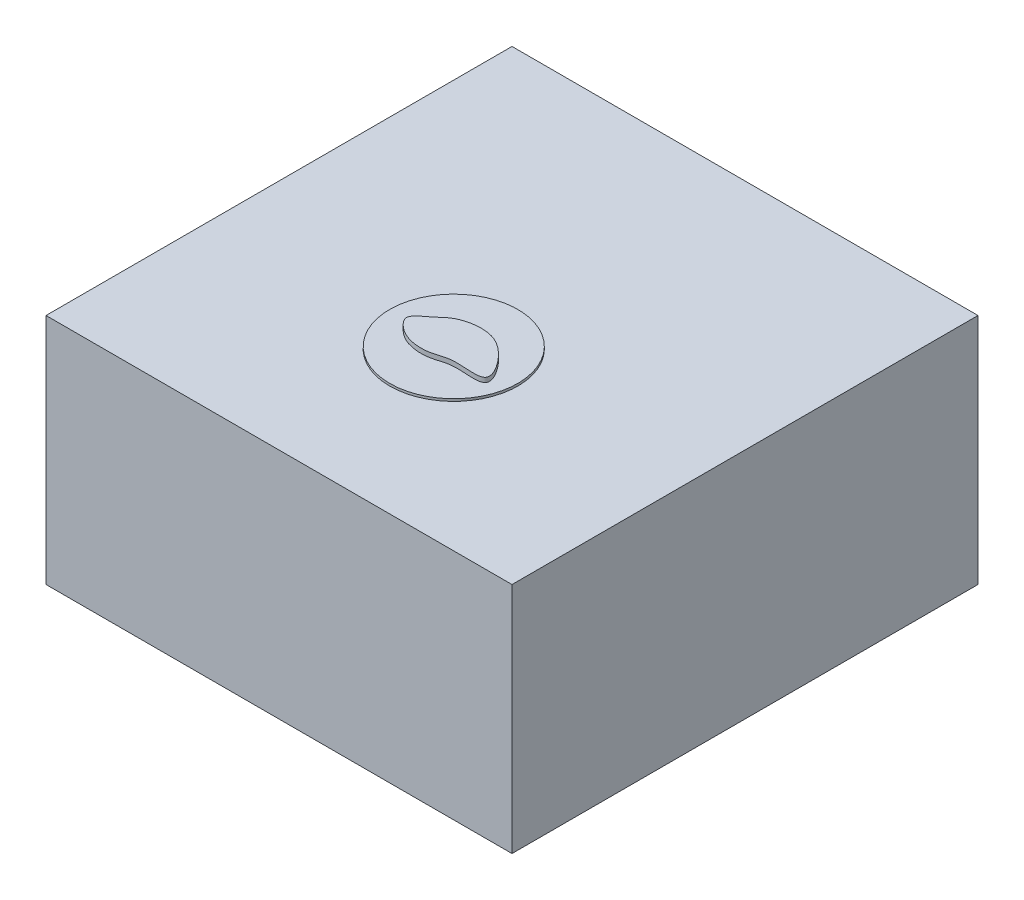
ISO-10303-21;
HEADER;
FILE_DESCRIPTION(('STEP AP214'),'2;1');
FILE_NAME('part.step','',(''),(''),'','','');
FILE_SCHEMA(('AUTOMOTIVE_DESIGN { 1 0 10303 214 1 1 1 1 }'));
ENDSEC;
DATA;
#1=APPLICATION_CONTEXT('core data for automotive mechanical design processes');
#2=APPLICATION_PROTOCOL_DEFINITION('international standard','automotive_design',2000,#1);
#3=PRODUCT_CONTEXT('',#1,'mechanical');
#4=PRODUCT('Part','Part','',(#3));
#5=PRODUCT_RELATED_PRODUCT_CATEGORY('part','',(#4));
#6=PRODUCT_DEFINITION_FORMATION('','',#4);
#7=PRODUCT_DEFINITION_CONTEXT('part definition',#1,'design');
#8=PRODUCT_DEFINITION('design','',#6,#7);
#9=PRODUCT_DEFINITION_SHAPE('','',#8);
#10=(LENGTH_UNIT() NAMED_UNIT(*) SI_UNIT(.MILLI.,.METRE.));
#11=(NAMED_UNIT(*) PLANE_ANGLE_UNIT() SI_UNIT($,.RADIAN.));
#12=(NAMED_UNIT(*) SI_UNIT($,.STERADIAN.) SOLID_ANGLE_UNIT());
#13=UNCERTAINTY_MEASURE_WITH_UNIT(LENGTH_MEASURE(1.E-05),#10,'distance_accuracy_value','');
#14=(GEOMETRIC_REPRESENTATION_CONTEXT(3) GLOBAL_UNCERTAINTY_ASSIGNED_CONTEXT((#13)) GLOBAL_UNIT_ASSIGNED_CONTEXT((#10,
#11,#12)) REPRESENTATION_CONTEXT('',''));
#15=CARTESIAN_POINT('',(0.,0.,0.));
#16=DIRECTION('',(0.,0.,1.));
#17=DIRECTION('',(1.,0.,0.));
#18=AXIS2_PLACEMENT_3D('',#15,#16,#17);
#19=CARTESIAN_POINT('',(-1.32978682457797,5.3,12.0470966404881));
#20=CARTESIAN_POINT('',(-1.56949938233388,5.3,12.2405123536894));
#21=CARTESIAN_POINT('',(-2.08614424851907,5.3,12.5391697720833));
#22=CARTESIAN_POINT('',(-1.58643209411403,5.3,13.1168891119311));
#23=CARTESIAN_POINT('',(-0.99479110722871,5.3,13.4609601521511));
#24=CARTESIAN_POINT('',(-0.122057096544853,5.3,13.5063472457396));
#25=CARTESIAN_POINT('',(0.780549472015395,5.3,13.1044677868928));
#26=CARTESIAN_POINT('',(2.65290980881673,5.3,13.5718372621998));
#27=CARTESIAN_POINT('',(1.37260667116618,5.3,11.7465735610997));
#28=CARTESIAN_POINT('',(0.251281573482777,5.3,11.3225744749199));
#29=CARTESIAN_POINT('',(-0.824147776626976,5.3,11.5489578340658));
#30=CARTESIAN_POINT('',(-1.19634203116918,5.3,11.9394246848268));
#31=CARTESIAN_POINT('',(-1.32978682457797,5.3,12.0470966404881));
#32=B_SPLINE_CURVE_WITH_KNOTS('',3,(#19,#20,#21,#22,#23,#24,#25,#26,#27,#28,#29,#30,#31),
.UNSPECIFIED.,.T.,.F.,(4,1,1,1,1,1,1,1,1,1,4),(0.,0.0890314863366276,0.133435272323839,
0.204833870138696,0.315562123210451,0.38661889368764,0.538438655581061,0.696738525235763,
0.817182112999442,0.95043735542146,1.),.UNSPECIFIED.);
#33=DIRECTION('',(0.,-1.,0.));
#34=VECTOR('',#33,1.);
#35=SURFACE_OF_LINEAR_EXTRUSION('',#32,#34);
#36=CARTESIAN_POINT('',(-1.32978682457797,5.3,12.0470966404881));
#37=VERTEX_POINT('',#36);
#38=EDGE_CURVE('E11',#37,#37,#32,.T.);
#39=ORIENTED_EDGE('',*,*,#38,.F.);
#40=EDGE_LOOP('',(#39));
#41=FACE_BOUND('',#40,.T.);
#42=CARTESIAN_POINT('',(-1.32978682457797,5.,12.0470966404881));
#43=CARTESIAN_POINT('',(-1.56949938233388,5.,12.2405123536894));
#44=CARTESIAN_POINT('',(-2.08614424851907,5.,12.5391697720833));
#45=CARTESIAN_POINT('',(-1.58643209411403,5.,13.1168891119311));
#46=CARTESIAN_POINT('',(-0.99479110722871,5.,13.4609601521511));
#47=CARTESIAN_POINT('',(-0.122057096544853,5.,13.5063472457396));
#48=CARTESIAN_POINT('',(0.780549472015395,5.,13.1044677868928));
#49=CARTESIAN_POINT('',(2.65290980881673,5.,13.5718372621998));
#50=CARTESIAN_POINT('',(1.37260667116618,5.,11.7465735610997));
#51=CARTESIAN_POINT('',(0.251281573482777,5.,11.3225744749199));
#52=CARTESIAN_POINT('',(-0.824147776626976,5.,11.5489578340658));
#53=CARTESIAN_POINT('',(-1.19634203116918,5.,11.9394246848268));
#54=CARTESIAN_POINT('',(-1.32978682457797,5.,12.0470966404881));
#55=B_SPLINE_CURVE_WITH_KNOTS('',3,(#42,#43,#44,#45,#46,#47,#48,#49,#50,#51,#52,#53,#54),
.UNSPECIFIED.,.T.,.F.,(4,1,1,1,1,1,1,1,1,1,4),(0.,0.0890314863366276,0.133435272323839,
0.204833870138696,0.315562123210451,0.38661889368764,0.538438655581061,0.696738525235763,
0.817182112999442,0.95043735542146,1.),.UNSPECIFIED.);
#56=CARTESIAN_POINT('',(-1.32978682457797,5.,12.0470966404881));
#57=VERTEX_POINT('',#56);
#58=EDGE_CURVE('E45',#57,#57,#55,.T.);
#59=ORIENTED_EDGE('',*,*,#58,.T.);
#60=EDGE_LOOP('',(#59));
#61=FACE_BOUND('',#60,.T.);
#62=ADVANCED_FACE('F41',(#41,#61),#35,.F.);
#63=CARTESIAN_POINT('',(1.81422588975815,5.3,13.257386496687));
#64=DIRECTION('',(0.,-1.,0.));
#65=DIRECTION('',(0.,0.,-1.));
#66=AXIS2_PLACEMENT_3D('',#63,#64,#65);
#67=PLANE('',#66);
#68=ORIENTED_EDGE('',*,*,#38,.T.);
#69=EDGE_LOOP('',(#68));
#70=FACE_BOUND('',#69,.T.);
#71=ADVANCED_FACE('F64',(#70),#67,.F.);
#72=CARTESIAN_POINT('',(1.81422588975815,5.,13.257386496687));
#73=DIRECTION('',(0.,-1.,0.));
#74=DIRECTION('',(0.,0.,-1.));
#75=AXIS2_PLACEMENT_3D('',#72,#73,#74);
#76=PLANE('',#75);
#77=ORIENTED_EDGE('',*,*,#58,.F.);
#78=EDGE_LOOP('',(#77));
#79=FACE_BOUND('',#78,.T.);
#80=ADVANCED_FACE('F62',(#79),#76,.T.);
#81=CLOSED_SHELL('',(#62,#71,#80));
#82=MANIFOLD_SOLID_BREP('B2',#81);
#83=CARTESIAN_POINT('',(0.5,5.,12.5));
#84=DIRECTION('',(0.,1.,0.));
#85=DIRECTION('',(0.,0.,1.));
#86=AXIS2_PLACEMENT_3D('',#83,#84,#85);
#87=CYLINDRICAL_SURFACE('',#86,0.00500000000000103);
#88=CARTESIAN_POINT('',(0.5,5.,12.5));
#89=DIRECTION('',(0.,-1.,0.));
#90=DIRECTION('',(0.,0.,1.));
#91=AXIS2_PLACEMENT_3D('',#88,#89,#90);
#92=CIRCLE('',#91,0.00500000000000103);
#93=CARTESIAN_POINT('',(0.5,5.,12.505));
#94=VERTEX_POINT('',#93);
#95=EDGE_CURVE('E40',#94,#94,#92,.T.);
#96=ORIENTED_EDGE('',*,*,#95,.F.);
#97=EDGE_LOOP('',(#96));
#98=FACE_BOUND('',#97,.T.);
#99=CARTESIAN_POINT('',(0.5,5.1,12.5));
#100=DIRECTION('',(0.,-1.,0.));
#101=DIRECTION('',(0.,0.,1.));
#102=AXIS2_PLACEMENT_3D('',#99,#100,#101);
#103=CIRCLE('',#102,0.00500000000000103);
#104=CARTESIAN_POINT('',(0.5,5.1,12.505));
#105=VERTEX_POINT('',#104);
#106=EDGE_CURVE('E103',#105,#105,#103,.T.);
#107=ORIENTED_EDGE('',*,*,#106,.T.);
#108=EDGE_LOOP('',(#107));
#109=FACE_BOUND('',#108,.T.);
#110=ADVANCED_FACE('F100',(#98,#109),#87,.T.);
#111=CARTESIAN_POINT('',(0.5,5.,12.5));
#112=DIRECTION('',(0.,1.,0.));
#113=DIRECTION('',(0.,0.,1.));
#114=AXIS2_PLACEMENT_3D('',#111,#112,#113);
#115=PLANE('',#114);
#116=ORIENTED_EDGE('',*,*,#95,.T.);
#117=EDGE_LOOP('',(#116));
#118=FACE_BOUND('',#117,.T.);
#119=ADVANCED_FACE('F115',(#118),#115,.F.);
#120=CARTESIAN_POINT('',(0.5,5.1,12.5));
#121=DIRECTION('',(0.,1.,0.));
#122=DIRECTION('',(0.,0.,1.));
#123=AXIS2_PLACEMENT_3D('',#120,#121,#122);
#124=PLANE('',#123);
#125=ORIENTED_EDGE('',*,*,#106,.F.);
#126=EDGE_LOOP('',(#125));
#127=FACE_BOUND('',#126,.T.);
#128=ADVANCED_FACE('F113',(#127),#124,.T.);
#129=CLOSED_SHELL('',(#110,#119,#128));
#130=MANIFOLD_SOLID_BREP('B6_NOT_SHOWN',#129);
#131=CARTESIAN_POINT('',(0.499999999999998,5.,12.));
#132=DIRECTION('',(0.,1.,0.));
#133=DIRECTION('',(0.,0.,1.));
#134=AXIS2_PLACEMENT_3D('',#131,#132,#133);
#135=CYLINDRICAL_SURFACE('',#134,0.00499999999999896);
#136=CARTESIAN_POINT('',(0.499999999999998,5.,12.));
#137=DIRECTION('',(0.,-1.,0.));
#138=DIRECTION('',(0.,0.,1.));
#139=AXIS2_PLACEMENT_3D('',#136,#137,#138);
#140=CIRCLE('',#139,0.00499999999999896);
#141=CARTESIAN_POINT('',(0.499999999999998,5.,12.005));
#142=VERTEX_POINT('',#141);
#143=EDGE_CURVE('E99',#142,#142,#140,.T.);
#144=ORIENTED_EDGE('',*,*,#143,.F.);
#145=EDGE_LOOP('',(#144));
#146=FACE_BOUND('',#145,.T.);
#147=CARTESIAN_POINT('',(0.499999999999998,5.1,12.));
#148=DIRECTION('',(0.,-1.,0.));
#149=DIRECTION('',(0.,0.,1.));
#150=AXIS2_PLACEMENT_3D('',#147,#148,#149);
#151=CIRCLE('',#150,0.00499999999999896);
#152=CARTESIAN_POINT('',(0.499999999999998,5.1,12.005));
#153=VERTEX_POINT('',#152);
#154=EDGE_CURVE('E151',#153,#153,#151,.T.);
#155=ORIENTED_EDGE('',*,*,#154,.T.);
#156=EDGE_LOOP('',(#155));
#157=FACE_BOUND('',#156,.T.);
#158=ADVANCED_FACE('F148',(#146,#157),#135,.T.);
#159=CARTESIAN_POINT('',(0.499999999999998,5.,12.));
#160=DIRECTION('',(0.,1.,0.));
#161=DIRECTION('',(0.,0.,1.));
#162=AXIS2_PLACEMENT_3D('',#159,#160,#161);
#163=PLANE('',#162);
#164=ORIENTED_EDGE('',*,*,#143,.T.);
#165=EDGE_LOOP('',(#164));
#166=FACE_BOUND('',#165,.T.);
#167=ADVANCED_FACE('F163',(#166),#163,.F.);
#168=CARTESIAN_POINT('',(0.499999999999998,5.1,12.));
#169=DIRECTION('',(0.,1.,0.));
#170=DIRECTION('',(0.,0.,1.));
#171=AXIS2_PLACEMENT_3D('',#168,#169,#170);
#172=PLANE('',#171);
#173=ORIENTED_EDGE('',*,*,#154,.F.);
#174=EDGE_LOOP('',(#173));
#175=FACE_BOUND('',#174,.T.);
#176=ADVANCED_FACE('F161',(#175),#172,.T.);
#177=CLOSED_SHELL('',(#158,#167,#176));
#178=MANIFOLD_SOLID_BREP('B35_NOT_SHOWN',#177);
#179=CARTESIAN_POINT('',(0.499999999999998,5.,13.));
#180=DIRECTION('',(0.,1.,0.));
#181=DIRECTION('',(0.,0.,1.));
#182=AXIS2_PLACEMENT_3D('',#179,#180,#181);
#183=CYLINDRICAL_SURFACE('',#182,0.00500000000000103);
#184=CARTESIAN_POINT('',(0.499999999999998,5.,13.));
#185=DIRECTION('',(0.,-1.,0.));
#186=DIRECTION('',(0.,0.,-1.));
#187=AXIS2_PLACEMENT_3D('',#184,#185,#186);
#188=CIRCLE('',#187,0.00500000000000103);
#189=CARTESIAN_POINT('',(0.499999999999998,5.,12.995));
#190=VERTEX_POINT('',#189);
#191=EDGE_CURVE('E147',#190,#190,#188,.T.);
#192=ORIENTED_EDGE('',*,*,#191,.F.);
#193=EDGE_LOOP('',(#192));
#194=FACE_BOUND('',#193,.T.);
#195=CARTESIAN_POINT('',(0.499999999999998,5.1,13.));
#196=DIRECTION('',(0.,-1.,0.));
#197=DIRECTION('',(0.,0.,-1.));
#198=AXIS2_PLACEMENT_3D('',#195,#196,#197);
#199=CIRCLE('',#198,0.00500000000000103);
#200=CARTESIAN_POINT('',(0.499999999999998,5.1,12.995));
#201=VERTEX_POINT('',#200);
#202=EDGE_CURVE('E199',#201,#201,#199,.T.);
#203=ORIENTED_EDGE('',*,*,#202,.T.);
#204=EDGE_LOOP('',(#203));
#205=FACE_BOUND('',#204,.T.);
#206=ADVANCED_FACE('F196',(#194,#205),#183,.T.);
#207=CARTESIAN_POINT('',(0.499999999999998,5.,13.));
#208=DIRECTION('',(0.,-1.,0.));
#209=DIRECTION('',(0.,0.,-1.));
#210=AXIS2_PLACEMENT_3D('',#207,#208,#209);
#211=PLANE('',#210);
#212=ORIENTED_EDGE('',*,*,#191,.T.);
#213=EDGE_LOOP('',(#212));
#214=FACE_BOUND('',#213,.T.);
#215=ADVANCED_FACE('F211',(#214),#211,.T.);
#216=CARTESIAN_POINT('',(0.499999999999998,5.1,13.));
#217=DIRECTION('',(0.,-1.,0.));
#218=DIRECTION('',(0.,0.,-1.));
#219=AXIS2_PLACEMENT_3D('',#216,#217,#218);
#220=PLANE('',#219);
#221=ORIENTED_EDGE('',*,*,#202,.F.);
#222=EDGE_LOOP('',(#221));
#223=FACE_BOUND('',#222,.T.);
#224=ADVANCED_FACE('F209',(#223),#220,.F.);
#225=CLOSED_SHELL('',(#206,#215,#224));
#226=MANIFOLD_SOLID_BREP('B94_NOT_SHOWN',#225);
#227=CARTESIAN_POINT('',(0.,5.,13.));
#228=DIRECTION('',(0.,1.,0.));
#229=DIRECTION('',(0.,0.,1.));
#230=AXIS2_PLACEMENT_3D('',#227,#228,#229);
#231=CYLINDRICAL_SURFACE('',#230,0.00500000000000099);
#232=CARTESIAN_POINT('',(0.,5.,13.));
#233=DIRECTION('',(0.,-1.,0.));
#234=DIRECTION('',(0.,0.,1.));
#235=AXIS2_PLACEMENT_3D('',#232,#233,#234);
#236=CIRCLE('',#235,0.00500000000000099);
#237=CARTESIAN_POINT('',(0.,5.,13.005));
#238=VERTEX_POINT('',#237);
#239=EDGE_CURVE('E195',#238,#238,#236,.T.);
#240=ORIENTED_EDGE('',*,*,#239,.F.);
#241=EDGE_LOOP('',(#240));
#242=FACE_BOUND('',#241,.T.);
#243=CARTESIAN_POINT('',(0.,5.1,13.));
#244=DIRECTION('',(0.,-1.,0.));
#245=DIRECTION('',(0.,0.,1.));
#246=AXIS2_PLACEMENT_3D('',#243,#244,#245);
#247=CIRCLE('',#246,0.00500000000000099);
#248=CARTESIAN_POINT('',(0.,5.1,13.005));
#249=VERTEX_POINT('',#248);
#250=EDGE_CURVE('E247',#249,#249,#247,.T.);
#251=ORIENTED_EDGE('',*,*,#250,.T.);
#252=EDGE_LOOP('',(#251));
#253=FACE_BOUND('',#252,.T.);
#254=ADVANCED_FACE('F244',(#242,#253),#231,.T.);
#255=CARTESIAN_POINT('',(0.,5.,13.));
#256=DIRECTION('',(0.,1.,0.));
#257=DIRECTION('',(0.,0.,1.));
#258=AXIS2_PLACEMENT_3D('',#255,#256,#257);
#259=PLANE('',#258);
#260=ORIENTED_EDGE('',*,*,#239,.T.);
#261=EDGE_LOOP('',(#260));
#262=FACE_BOUND('',#261,.T.);
#263=ADVANCED_FACE('F259',(#262),#259,.F.);
#264=CARTESIAN_POINT('',(0.,5.1,13.));
#265=DIRECTION('',(0.,1.,0.));
#266=DIRECTION('',(0.,0.,1.));
#267=AXIS2_PLACEMENT_3D('',#264,#265,#266);
#268=PLANE('',#267);
#269=ORIENTED_EDGE('',*,*,#250,.F.);
#270=EDGE_LOOP('',(#269));
#271=FACE_BOUND('',#270,.T.);
#272=ADVANCED_FACE('F257',(#271),#268,.T.);
#273=CLOSED_SHELL('',(#254,#263,#272));
#274=MANIFOLD_SOLID_BREP('B142_NOT_SHOWN',#273);
#275=CARTESIAN_POINT('',(-0.499999999999998,5.,13.));
#276=DIRECTION('',(0.,1.,0.));
#277=DIRECTION('',(0.,0.,1.));
#278=AXIS2_PLACEMENT_3D('',#275,#276,#277);
#279=CYLINDRICAL_SURFACE('',#278,0.00500000000000103);
#280=CARTESIAN_POINT('',(-0.499999999999998,5.,13.));
#281=DIRECTION('',(0.,-1.,0.));
#282=DIRECTION('',(0.,0.,1.));
#283=AXIS2_PLACEMENT_3D('',#280,#281,#282);
#284=CIRCLE('',#283,0.00500000000000103);
#285=CARTESIAN_POINT('',(-0.499999999999998,5.,13.005));
#286=VERTEX_POINT('',#285);
#287=EDGE_CURVE('E243',#286,#286,#284,.T.);
#288=ORIENTED_EDGE('',*,*,#287,.F.);
#289=EDGE_LOOP('',(#288));
#290=FACE_BOUND('',#289,.T.);
#291=CARTESIAN_POINT('',(-0.499999999999998,5.1,13.));
#292=DIRECTION('',(0.,-1.,0.));
#293=DIRECTION('',(0.,0.,1.));
#294=AXIS2_PLACEMENT_3D('',#291,#292,#293);
#295=CIRCLE('',#294,0.00500000000000103);
#296=CARTESIAN_POINT('',(-0.499999999999998,5.1,13.005));
#297=VERTEX_POINT('',#296);
#298=EDGE_CURVE('E295',#297,#297,#295,.T.);
#299=ORIENTED_EDGE('',*,*,#298,.T.);
#300=EDGE_LOOP('',(#299));
#301=FACE_BOUND('',#300,.T.);
#302=ADVANCED_FACE('F292',(#290,#301),#279,.T.);
#303=CARTESIAN_POINT('',(-0.499999999999998,5.,13.));
#304=DIRECTION('',(0.,1.,0.));
#305=DIRECTION('',(0.,0.,1.));
#306=AXIS2_PLACEMENT_3D('',#303,#304,#305);
#307=PLANE('',#306);
#308=ORIENTED_EDGE('',*,*,#287,.T.);
#309=EDGE_LOOP('',(#308));
#310=FACE_BOUND('',#309,.T.);
#311=ADVANCED_FACE('F307',(#310),#307,.F.);
#312=CARTESIAN_POINT('',(-0.499999999999998,5.1,13.));
#313=DIRECTION('',(0.,1.,0.));
#314=DIRECTION('',(0.,0.,1.));
#315=AXIS2_PLACEMENT_3D('',#312,#313,#314);
#316=PLANE('',#315);
#317=ORIENTED_EDGE('',*,*,#298,.F.);
#318=EDGE_LOOP('',(#317));
#319=FACE_BOUND('',#318,.T.);
#320=ADVANCED_FACE('F305',(#319),#316,.T.);
#321=CLOSED_SHELL('',(#302,#311,#320));
#322=MANIFOLD_SOLID_BREP('B190_NOT_SHOWN',#321);
#323=CARTESIAN_POINT('',(0.,5.,12.));
#324=DIRECTION('',(0.,1.,0.));
#325=DIRECTION('',(0.,0.,1.));
#326=AXIS2_PLACEMENT_3D('',#323,#324,#325);
#327=CYLINDRICAL_SURFACE('',#326,0.00499999999999898);
#328=CARTESIAN_POINT('',(0.,5.,12.));
#329=DIRECTION('',(0.,-1.,0.));
#330=DIRECTION('',(0.,0.,-1.));
#331=AXIS2_PLACEMENT_3D('',#328,#329,#330);
#332=CIRCLE('',#331,0.00499999999999898);
#333=CARTESIAN_POINT('',(0.,5.,11.995));
#334=VERTEX_POINT('',#333);
#335=EDGE_CURVE('E291',#334,#334,#332,.T.);
#336=ORIENTED_EDGE('',*,*,#335,.F.);
#337=EDGE_LOOP('',(#336));
#338=FACE_BOUND('',#337,.T.);
#339=CARTESIAN_POINT('',(0.,5.1,12.));
#340=DIRECTION('',(0.,-1.,0.));
#341=DIRECTION('',(0.,0.,-1.));
#342=AXIS2_PLACEMENT_3D('',#339,#340,#341);
#343=CIRCLE('',#342,0.00499999999999898);
#344=CARTESIAN_POINT('',(0.,5.1,11.995));
#345=VERTEX_POINT('',#344);
#346=EDGE_CURVE('E343',#345,#345,#343,.T.);
#347=ORIENTED_EDGE('',*,*,#346,.T.);
#348=EDGE_LOOP('',(#347));
#349=FACE_BOUND('',#348,.T.);
#350=ADVANCED_FACE('F340',(#338,#349),#327,.T.);
#351=CARTESIAN_POINT('',(0.,5.,12.));
#352=DIRECTION('',(0.,-1.,0.));
#353=DIRECTION('',(0.,0.,-1.));
#354=AXIS2_PLACEMENT_3D('',#351,#352,#353);
#355=PLANE('',#354);
#356=ORIENTED_EDGE('',*,*,#335,.T.);
#357=EDGE_LOOP('',(#356));
#358=FACE_BOUND('',#357,.T.);
#359=ADVANCED_FACE('F355',(#358),#355,.T.);
#360=CARTESIAN_POINT('',(0.,5.1,12.));
#361=DIRECTION('',(0.,-1.,0.));
#362=DIRECTION('',(0.,0.,-1.));
#363=AXIS2_PLACEMENT_3D('',#360,#361,#362);
#364=PLANE('',#363);
#365=ORIENTED_EDGE('',*,*,#346,.F.);
#366=EDGE_LOOP('',(#365));
#367=FACE_BOUND('',#366,.T.);
#368=ADVANCED_FACE('F353',(#367),#364,.F.);
#369=CLOSED_SHELL('',(#350,#359,#368));
#370=MANIFOLD_SOLID_BREP('B238_NOT_SHOWN',#369);
#371=CARTESIAN_POINT('',(-0.499999999999998,5.,12.));
#372=DIRECTION('',(0.,1.,0.));
#373=DIRECTION('',(0.,0.,1.));
#374=AXIS2_PLACEMENT_3D('',#371,#372,#373);
#375=CYLINDRICAL_SURFACE('',#374,0.00499999999999896);
#376=CARTESIAN_POINT('',(-0.499999999999998,5.,12.));
#377=DIRECTION('',(0.,-1.,0.));
#378=DIRECTION('',(0.,0.,-1.));
#379=AXIS2_PLACEMENT_3D('',#376,#377,#378);
#380=CIRCLE('',#379,0.00499999999999896);
#381=CARTESIAN_POINT('',(-0.499999999999998,5.,11.995));
#382=VERTEX_POINT('',#381);
#383=EDGE_CURVE('E339',#382,#382,#380,.T.);
#384=ORIENTED_EDGE('',*,*,#383,.F.);
#385=EDGE_LOOP('',(#384));
#386=FACE_BOUND('',#385,.T.);
#387=CARTESIAN_POINT('',(-0.499999999999998,5.1,12.));
#388=DIRECTION('',(0.,-1.,0.));
#389=DIRECTION('',(0.,0.,-1.));
#390=AXIS2_PLACEMENT_3D('',#387,#388,#389);
#391=CIRCLE('',#390,0.00499999999999896);
#392=CARTESIAN_POINT('',(-0.499999999999998,5.1,11.995));
#393=VERTEX_POINT('',#392);
#394=EDGE_CURVE('E391',#393,#393,#391,.T.);
#395=ORIENTED_EDGE('',*,*,#394,.T.);
#396=EDGE_LOOP('',(#395));
#397=FACE_BOUND('',#396,.T.);
#398=ADVANCED_FACE('F388',(#386,#397),#375,.T.);
#399=CARTESIAN_POINT('',(-0.499999999999998,5.,12.));
#400=DIRECTION('',(0.,-1.,0.));
#401=DIRECTION('',(0.,0.,-1.));
#402=AXIS2_PLACEMENT_3D('',#399,#400,#401);
#403=PLANE('',#402);
#404=ORIENTED_EDGE('',*,*,#383,.T.);
#405=EDGE_LOOP('',(#404));
#406=FACE_BOUND('',#405,.T.);
#407=ADVANCED_FACE('F403',(#406),#403,.T.);
#408=CARTESIAN_POINT('',(-0.499999999999998,5.1,12.));
#409=DIRECTION('',(0.,-1.,0.));
#410=DIRECTION('',(0.,0.,-1.));
#411=AXIS2_PLACEMENT_3D('',#408,#409,#410);
#412=PLANE('',#411);
#413=ORIENTED_EDGE('',*,*,#394,.F.);
#414=EDGE_LOOP('',(#413));
#415=FACE_BOUND('',#414,.T.);
#416=ADVANCED_FACE('F401',(#415),#412,.F.);
#417=CLOSED_SHELL('',(#398,#407,#416));
#418=MANIFOLD_SOLID_BREP('B286_NOT_SHOWN',#417);
#419=CARTESIAN_POINT('',(-0.5,5.,12.5));
#420=DIRECTION('',(0.,1.,0.));
#421=DIRECTION('',(0.,0.,1.));
#422=AXIS2_PLACEMENT_3D('',#419,#420,#421);
#423=CYLINDRICAL_SURFACE('',#422,0.00500000000000103);
#424=CARTESIAN_POINT('',(-0.5,5.,12.5));
#425=DIRECTION('',(0.,-1.,0.));
#426=DIRECTION('',(0.,0.,-1.));
#427=AXIS2_PLACEMENT_3D('',#424,#425,#426);
#428=CIRCLE('',#427,0.00500000000000103);
#429=CARTESIAN_POINT('',(-0.5,5.,12.495));
#430=VERTEX_POINT('',#429);
#431=EDGE_CURVE('E387',#430,#430,#428,.T.);
#432=ORIENTED_EDGE('',*,*,#431,.F.);
#433=EDGE_LOOP('',(#432));
#434=FACE_BOUND('',#433,.T.);
#435=CARTESIAN_POINT('',(-0.5,5.1,12.5));
#436=DIRECTION('',(0.,-1.,0.));
#437=DIRECTION('',(0.,0.,-1.));
#438=AXIS2_PLACEMENT_3D('',#435,#436,#437);
#439=CIRCLE('',#438,0.00500000000000103);
#440=CARTESIAN_POINT('',(-0.5,5.1,12.495));
#441=VERTEX_POINT('',#440);
#442=EDGE_CURVE('E439',#441,#441,#439,.T.);
#443=ORIENTED_EDGE('',*,*,#442,.T.);
#444=EDGE_LOOP('',(#443));
#445=FACE_BOUND('',#444,.T.);
#446=ADVANCED_FACE('F436',(#434,#445),#423,.T.);
#447=CARTESIAN_POINT('',(-0.5,5.,12.5));
#448=DIRECTION('',(0.,-1.,0.));
#449=DIRECTION('',(0.,0.,-1.));
#450=AXIS2_PLACEMENT_3D('',#447,#448,#449);
#451=PLANE('',#450);
#452=ORIENTED_EDGE('',*,*,#431,.T.);
#453=EDGE_LOOP('',(#452));
#454=FACE_BOUND('',#453,.T.);
#455=ADVANCED_FACE('F451',(#454),#451,.T.);
#456=CARTESIAN_POINT('',(-0.5,5.1,12.5));
#457=DIRECTION('',(0.,-1.,0.));
#458=DIRECTION('',(0.,0.,-1.));
#459=AXIS2_PLACEMENT_3D('',#456,#457,#458);
#460=PLANE('',#459);
#461=ORIENTED_EDGE('',*,*,#442,.F.);
#462=EDGE_LOOP('',(#461));
#463=FACE_BOUND('',#462,.T.);
#464=ADVANCED_FACE('F449',(#463),#460,.F.);
#465=CLOSED_SHELL('',(#446,#455,#464));
#466=MANIFOLD_SOLID_BREP('B334_NOT_SHOWN',#465);
#467=CARTESIAN_POINT('',(0.,5.,12.5));
#468=DIRECTION('',(0.,1.,0.));
#469=DIRECTION('',(0.,0.,1.));
#470=AXIS2_PLACEMENT_3D('',#467,#468,#469);
#471=CYLINDRICAL_SURFACE('',#470,0.00500000000000099);
#472=CARTESIAN_POINT('',(0.,5.,12.5));
#473=DIRECTION('',(0.,-1.,0.));
#474=DIRECTION('',(0.,0.,-1.));
#475=AXIS2_PLACEMENT_3D('',#472,#473,#474);
#476=CIRCLE('',#475,0.00500000000000099);
#477=CARTESIAN_POINT('',(0.,5.,12.495));
#478=VERTEX_POINT('',#477);
#479=EDGE_CURVE('E435',#478,#478,#476,.T.);
#480=ORIENTED_EDGE('',*,*,#479,.F.);
#481=EDGE_LOOP('',(#480));
#482=FACE_BOUND('',#481,.T.);
#483=CARTESIAN_POINT('',(0.,5.1,12.5));
#484=DIRECTION('',(0.,-1.,0.));
#485=DIRECTION('',(0.,0.,-1.));
#486=AXIS2_PLACEMENT_3D('',#483,#484,#485);
#487=CIRCLE('',#486,0.00500000000000099);
#488=CARTESIAN_POINT('',(0.,5.1,12.495));
#489=VERTEX_POINT('',#488);
#490=EDGE_CURVE('E487',#489,#489,#487,.T.);
#491=ORIENTED_EDGE('',*,*,#490,.T.);
#492=EDGE_LOOP('',(#491));
#493=FACE_BOUND('',#492,.T.);
#494=ADVANCED_FACE('F484',(#482,#493),#471,.T.);
#495=CARTESIAN_POINT('',(0.,5.,12.5));
#496=DIRECTION('',(0.,-1.,0.));
#497=DIRECTION('',(0.,0.,-1.));
#498=AXIS2_PLACEMENT_3D('',#495,#496,#497);
#499=PLANE('',#498);
#500=ORIENTED_EDGE('',*,*,#479,.T.);
#501=EDGE_LOOP('',(#500));
#502=FACE_BOUND('',#501,.T.);
#503=ADVANCED_FACE('F499',(#502),#499,.T.);
#504=CARTESIAN_POINT('',(0.,5.1,12.5));
#505=DIRECTION('',(0.,-1.,0.));
#506=DIRECTION('',(0.,0.,-1.));
#507=AXIS2_PLACEMENT_3D('',#504,#505,#506);
#508=PLANE('',#507);
#509=ORIENTED_EDGE('',*,*,#490,.F.);
#510=EDGE_LOOP('',(#509));
#511=FACE_BOUND('',#510,.T.);
#512=ADVANCED_FACE('F497',(#511),#508,.F.);
#513=CLOSED_SHELL('',(#494,#503,#512));
#514=MANIFOLD_SOLID_BREP('B382_NOT_SHOWN',#513);
#515=CARTESIAN_POINT('',(0.,5.1,12.5));
#516=DIRECTION('',(0.,-1.,0.));
#517=DIRECTION('',(0.,0.,-1.));
#518=AXIS2_PLACEMENT_3D('',#515,#516,#517);
#519=CYLINDRICAL_SURFACE('',#518,2.75);
#520=CARTESIAN_POINT('',(0.,5.1,12.5));
#521=DIRECTION('',(0.,1.,0.));
#522=DIRECTION('',(0.,0.,1.));
#523=AXIS2_PLACEMENT_3D('',#520,#521,#522);
#524=CIRCLE('',#523,2.75);
#525=CARTESIAN_POINT('',(0.,5.1,15.25));
#526=VERTEX_POINT('',#525);
#527=EDGE_CURVE('E483',#526,#526,#524,.T.);
#528=ORIENTED_EDGE('',*,*,#527,.F.);
#529=EDGE_LOOP('',(#528));
#530=FACE_BOUND('',#529,.T.);
#531=CARTESIAN_POINT('',(0.,5.,12.5));
#532=DIRECTION('',(0.,1.,0.));
#533=DIRECTION('',(0.,0.,1.));
#534=AXIS2_PLACEMENT_3D('',#531,#532,#533);
#535=CIRCLE('',#534,2.75);
#536=CARTESIAN_POINT('',(0.,5.,15.25));
#537=VERTEX_POINT('',#536);
#538=EDGE_CURVE('E535',#537,#537,#535,.T.);
#539=ORIENTED_EDGE('',*,*,#538,.T.);
#540=EDGE_LOOP('',(#539));
#541=FACE_BOUND('',#540,.T.);
#542=ADVANCED_FACE('F532',(#530,#541),#519,.T.);
#543=CARTESIAN_POINT('',(0.,5.1,12.5));
#544=DIRECTION('',(0.,1.,0.));
#545=DIRECTION('',(0.,0.,1.));
#546=AXIS2_PLACEMENT_3D('',#543,#544,#545);
#547=PLANE('',#546);
#548=ORIENTED_EDGE('',*,*,#527,.T.);
#549=EDGE_LOOP('',(#548));
#550=FACE_BOUND('',#549,.T.);
#551=ADVANCED_FACE('F547',(#550),#547,.T.);
#552=CARTESIAN_POINT('',(0.,5.,12.5));
#553=DIRECTION('',(0.,1.,0.));
#554=DIRECTION('',(0.,0.,1.));
#555=AXIS2_PLACEMENT_3D('',#552,#553,#554);
#556=PLANE('',#555);
#557=ORIENTED_EDGE('',*,*,#538,.F.);
#558=EDGE_LOOP('',(#557));
#559=FACE_BOUND('',#558,.T.);
#560=ADVANCED_FACE('F545',(#559),#556,.F.);
#561=CLOSED_SHELL('',(#542,#551,#560));
#562=MANIFOLD_SOLID_BREP('B430_NOT_SHOWN',#561);
#563=CARTESIAN_POINT('',(7.5,4.,20.));
#564=DIRECTION('',(0.,0.,-1.));
#565=DIRECTION('',(-1.,0.,0.));
#566=AXIS2_PLACEMENT_3D('',#563,#564,#565);
#567=PLANE('',#566);
#568=CARTESIAN_POINT('',(7.5,4.,20.));
#569=DIRECTION('',(0.,0.,1.));
#570=DIRECTION('',(-1.,0.,0.));
#571=AXIS2_PLACEMENT_3D('',#568,#569,#570);
#572=CIRCLE('',#571,0.500000000000004);
#573=CARTESIAN_POINT('',(6.99999999999999,4.,20.));
#574=VERTEX_POINT('',#573);
#575=EDGE_CURVE('E590',#574,#574,#572,.T.);
#576=ORIENTED_EDGE('',*,*,#575,.T.);
#577=EDGE_LOOP('',(#576));
#578=FACE_BOUND('',#577,.T.);
#579=ADVANCED_FACE('F580',(#578),#567,.F.);
#580=CARTESIAN_POINT('',(7.5,5.,4.));
#581=DIRECTION('',(0.,1.,0.));
#582=DIRECTION('',(-1.,0.,0.));
#583=AXIS2_PLACEMENT_3D('',#580,#581,#582);
#584=PLANE('',#583);
#585=CARTESIAN_POINT('',(7.5,5.,4.));
#586=DIRECTION('',(0.,-1.,0.));
#587=DIRECTION('',(-1.,0.,0.));
#588=AXIS2_PLACEMENT_3D('',#585,#586,#587);
#589=CIRCLE('',#588,0.500000000000004);
#590=CARTESIAN_POINT('',(7.5,5.,3.5));
#591=VERTEX_POINT('',#590);
#592=EDGE_CURVE('E531',#591,#591,#589,.T.);
#593=ORIENTED_EDGE('',*,*,#592,.F.);
#594=EDGE_LOOP('',(#593));
#595=FACE_BOUND('',#594,.T.);
#596=ADVANCED_FACE('F601',(#595),#584,.T.);
#597=CARTESIAN_POINT('',(7.5,4.,20.));
#598=DIRECTION('',(0.,0.,-1.));
#599=DIRECTION('',(-1.,0.,0.));
#600=AXIS2_PLACEMENT_3D('',#597,#598,#599);
#601=CYLINDRICAL_SURFACE('',#600,0.500000000000004);
#602=CARTESIAN_POINT('',(7.5,4.,5.));
#603=DIRECTION('',(0.,0.,1.));
#604=DIRECTION('',(-1.,0.,0.));
#605=AXIS2_PLACEMENT_3D('',#602,#603,#604);
#606=CIRCLE('',#605,0.500000000000004);
#607=CARTESIAN_POINT('',(7.5,3.5,5.));
#608=VERTEX_POINT('',#607);
#609=EDGE_CURVE('E586',#608,#608,#606,.T.);
#610=ORIENTED_EDGE('',*,*,#609,.T.);
#611=EDGE_LOOP('',(#610));
#612=FACE_BOUND('',#611,.T.);
#613=ORIENTED_EDGE('',*,*,#575,.F.);
#614=EDGE_LOOP('',(#613));
#615=FACE_BOUND('',#614,.T.);
#616=ADVANCED_FACE('F598',(#612,#615),#601,.T.);
#617=CARTESIAN_POINT('',(7.5,5.,5.));
#618=DIRECTION('',(1.,0.,0.));
#619=DIRECTION('',(0.,0.,-1.));
#620=AXIS2_PLACEMENT_3D('',#617,#618,#619);
#621=TOROIDAL_SURFACE('',#620,0.999999999999998,0.500000000000004);
#622=CARTESIAN_POINT('',(7.5,5.,5.));
#623=DIRECTION('',(1.,0.,0.));
#624=DIRECTION('',(0.,0.,-1.));
#625=AXIS2_PLACEMENT_3D('',#622,#623,#624);
#626=CIRCLE('',#625,1.5);
#627=EDGE_CURVE('',#608,#591,#626,.T.);
#628=ORIENTED_EDGE('',*,*,#609,.F.);
#629=ORIENTED_EDGE('',*,*,#592,.T.);
#630=ORIENTED_EDGE('',*,*,#627,.T.);
#631=ORIENTED_EDGE('',*,*,#627,.F.);
#632=EDGE_LOOP('',(#628,#630,#629,#631));
#633=FACE_BOUND('',#632,.T.);
#634=ADVANCED_FACE('F600',(#633),#621,.T.);
#635=CLOSED_SHELL('',(#579,#596,#616,#634));
#636=MANIFOLD_SOLID_BREP('B478',#635);
#637=CARTESIAN_POINT('',(-7.5,4.,20.));
#638=DIRECTION('',(0.,0.,1.));
#639=DIRECTION('',(1.,0.,0.));
#640=AXIS2_PLACEMENT_3D('',#637,#638,#639);
#641=PLANE('',#640);
#642=CARTESIAN_POINT('',(-7.5,4.,20.));
#643=DIRECTION('',(0.,0.,1.));
#644=DIRECTION('',(1.,0.,0.));
#645=AXIS2_PLACEMENT_3D('',#642,#643,#644);
#646=CIRCLE('',#645,0.500000000000002);
#647=CARTESIAN_POINT('',(-7.,4.,20.));
#648=VERTEX_POINT('',#647);
#649=EDGE_CURVE('E654',#648,#648,#646,.T.);
#650=ORIENTED_EDGE('',*,*,#649,.T.);
#651=EDGE_LOOP('',(#650));
#652=FACE_BOUND('',#651,.T.);
#653=ADVANCED_FACE('F644',(#652),#641,.T.);
#654=CARTESIAN_POINT('',(-7.5,5.,4.));
#655=DIRECTION('',(0.,-1.,0.));
#656=DIRECTION('',(1.,0.,0.));
#657=AXIS2_PLACEMENT_3D('',#654,#655,#656);
#658=PLANE('',#657);
#659=CARTESIAN_POINT('',(-7.5,5.,4.));
#660=DIRECTION('',(0.,-1.,0.));
#661=DIRECTION('',(1.,0.,0.));
#662=AXIS2_PLACEMENT_3D('',#659,#660,#661);
#663=CIRCLE('',#662,0.500000000000002);
#664=CARTESIAN_POINT('',(-7.5,5.,3.5));
#665=VERTEX_POINT('',#664);
#666=EDGE_CURVE('E579',#665,#665,#663,.T.);
#667=ORIENTED_EDGE('',*,*,#666,.F.);
#668=EDGE_LOOP('',(#667));
#669=FACE_BOUND('',#668,.T.);
#670=ADVANCED_FACE('F665',(#669),#658,.F.);
#671=CARTESIAN_POINT('',(-7.5,4.,20.));
#672=DIRECTION('',(0.,0.,-1.));
#673=DIRECTION('',(-1.,0.,0.));
#674=AXIS2_PLACEMENT_3D('',#671,#672,#673);
#675=CYLINDRICAL_SURFACE('',#674,0.500000000000002);
#676=CARTESIAN_POINT('',(-7.5,4.,5.));
#677=DIRECTION('',(0.,0.,1.));
#678=DIRECTION('',(1.,0.,0.));
#679=AXIS2_PLACEMENT_3D('',#676,#677,#678);
#680=CIRCLE('',#679,0.500000000000002);
#681=CARTESIAN_POINT('',(-7.5,3.5,5.));
#682=VERTEX_POINT('',#681);
#683=EDGE_CURVE('E650',#682,#682,#680,.T.);
#684=ORIENTED_EDGE('',*,*,#683,.T.);
#685=EDGE_LOOP('',(#684));
#686=FACE_BOUND('',#685,.T.);
#687=ORIENTED_EDGE('',*,*,#649,.F.);
#688=EDGE_LOOP('',(#687));
#689=FACE_BOUND('',#688,.T.);
#690=ADVANCED_FACE('F662',(#686,#689),#675,.T.);
#691=CARTESIAN_POINT('',(-7.5,5.,5.));
#692=DIRECTION('',(1.,0.,0.));
#693=DIRECTION('',(0.,0.,-1.));
#694=AXIS2_PLACEMENT_3D('',#691,#692,#693);
#695=TOROIDAL_SURFACE('',#694,1.,0.500000000000002);
#696=CARTESIAN_POINT('',(-7.5,5.,5.));
#697=DIRECTION('',(1.,0.,0.));
#698=DIRECTION('',(0.,0.,-1.));
#699=AXIS2_PLACEMENT_3D('',#696,#697,#698);
#700=CIRCLE('',#699,1.5);
#701=EDGE_CURVE('',#682,#665,#700,.T.);
#702=ORIENTED_EDGE('',*,*,#683,.F.);
#703=ORIENTED_EDGE('',*,*,#666,.T.);
#704=ORIENTED_EDGE('',*,*,#701,.T.);
#705=ORIENTED_EDGE('',*,*,#701,.F.);
#706=EDGE_LOOP('',(#702,#704,#703,#705));
#707=FACE_BOUND('',#706,.T.);
#708=ADVANCED_FACE('F664',(#707),#695,.T.);
#709=CLOSED_SHELL('',(#653,#670,#690,#708));
#710=MANIFOLD_SOLID_BREP('B526',#709);
#711=CARTESIAN_POINT('',(10.,-5.,20.));
#712=DIRECTION('',(-1.,0.,0.));
#713=DIRECTION('',(0.,0.,1.));
#714=AXIS2_PLACEMENT_3D('',#711,#712,#713);
#715=PLANE('',#714);
#716=DIRECTION('',(0.,1.,0.));
#717=VECTOR('',#716,1.);
#718=CARTESIAN_POINT('',(10.,-5.,0.));
#719=LINE('',#718,#717);
#720=CARTESIAN_POINT('',(10.,-5.,0.));
#721=VERTEX_POINT('',#720);
#722=CARTESIAN_POINT('',(10.,5.,0.));
#723=VERTEX_POINT('',#722);
#724=EDGE_CURVE('E762',#721,#723,#719,.T.);
#725=ORIENTED_EDGE('',*,*,#724,.T.);
#726=DIRECTION('',(0.,0.,-1.));
#727=VECTOR('',#726,1.);
#728=CARTESIAN_POINT('',(10.,5.,20.));
#729=LINE('',#728,#727);
#730=CARTESIAN_POINT('',(10.,5.,20.));
#731=VERTEX_POINT('',#730);
#732=EDGE_CURVE('E642',#731,#723,#729,.T.);
#733=ORIENTED_EDGE('',*,*,#732,.F.);
#734=DIRECTION('',(0.,1.,0.));
#735=VECTOR('',#734,1.);
#736=CARTESIAN_POINT('',(10.,-5.,20.));
#737=LINE('',#736,#735);
#738=CARTESIAN_POINT('',(10.,-5.,20.));
#739=VERTEX_POINT('',#738);
#740=EDGE_CURVE('E750',#739,#731,#737,.T.);
#741=ORIENTED_EDGE('',*,*,#740,.F.);
#742=DIRECTION('',(0.,0.,-1.));
#743=VECTOR('',#742,1.);
#744=CARTESIAN_POINT('',(10.,-5.,20.));
#745=LINE('',#744,#743);
#746=EDGE_CURVE('E758',#739,#721,#745,.T.);
#747=ORIENTED_EDGE('',*,*,#746,.T.);
#748=EDGE_LOOP('',(#725,#733,#741,#747));
#749=FACE_BOUND('',#748,.T.);
#750=ADVANCED_FACE('F699',(#749),#715,.F.);
#751=CARTESIAN_POINT('',(-10.,5.,20.));
#752=DIRECTION('',(0.,-1.,0.));
#753=DIRECTION('',(0.,0.,-1.));
#754=AXIS2_PLACEMENT_3D('',#751,#752,#753);
#755=PLANE('',#754);
#756=DIRECTION('',(-1.,0.,0.));
#757=VECTOR('',#756,1.);
#758=CARTESIAN_POINT('',(-10.,5.,0.));
#759=LINE('',#758,#757);
#760=CARTESIAN_POINT('',(-10.,5.,0.));
#761=VERTEX_POINT('',#760);
#762=EDGE_CURVE('E754',#723,#761,#759,.T.);
#763=ORIENTED_EDGE('',*,*,#762,.T.);
#764=DIRECTION('',(0.,0.,-1.));
#765=VECTOR('',#764,1.);
#766=CARTESIAN_POINT('',(-10.,5.,20.));
#767=LINE('',#766,#765);
#768=CARTESIAN_POINT('',(-10.,5.,20.));
#769=VERTEX_POINT('',#768);
#770=EDGE_CURVE('E707',#769,#761,#767,.T.);
#771=ORIENTED_EDGE('',*,*,#770,.F.);
#772=DIRECTION('',(-1.,0.,0.));
#773=VECTOR('',#772,1.);
#774=CARTESIAN_POINT('',(-10.,5.,20.));
#775=LINE('',#774,#773);
#776=EDGE_CURVE('E745',#731,#769,#775,.T.);
#777=ORIENTED_EDGE('',*,*,#776,.F.);
#778=ORIENTED_EDGE('',*,*,#732,.T.);
#779=EDGE_LOOP('',(#763,#771,#777,#778));
#780=FACE_BOUND('',#779,.T.);
#781=ADVANCED_FACE('F753',(#780),#755,.F.);
#782=CARTESIAN_POINT('',(-10.,-5.,20.));
#783=DIRECTION('',(1.,0.,0.));
#784=DIRECTION('',(0.,1.,0.));
#785=AXIS2_PLACEMENT_3D('',#782,#783,#784);
#786=PLANE('',#785);
#787=DIRECTION('',(0.,-1.,0.));
#788=VECTOR('',#787,1.);
#789=CARTESIAN_POINT('',(-10.,-5.,0.));
#790=LINE('',#789,#788);
#791=CARTESIAN_POINT('',(-10.,-5.,0.));
#792=VERTEX_POINT('',#791);
#793=EDGE_CURVE('E732',#761,#792,#790,.T.);
#794=ORIENTED_EDGE('',*,*,#793,.T.);
#795=DIRECTION('',(0.,0.,-1.));
#796=VECTOR('',#795,1.);
#797=CARTESIAN_POINT('',(-10.,-5.,20.));
#798=LINE('',#797,#796);
#799=CARTESIAN_POINT('',(-10.,-5.,20.));
#800=VERTEX_POINT('',#799);
#801=EDGE_CURVE('E755',#800,#792,#798,.T.);
#802=ORIENTED_EDGE('',*,*,#801,.F.);
#803=DIRECTION('',(0.,-1.,0.));
#804=VECTOR('',#803,1.);
#805=CARTESIAN_POINT('',(-10.,-5.,20.));
#806=LINE('',#805,#804);
#807=EDGE_CURVE('E748',#769,#800,#806,.T.);
#808=ORIENTED_EDGE('',*,*,#807,.F.);
#809=ORIENTED_EDGE('',*,*,#770,.T.);
#810=EDGE_LOOP('',(#794,#802,#808,#809));
#811=FACE_BOUND('',#810,.T.);
#812=ADVANCED_FACE('F756',(#811),#786,.F.);
#813=CARTESIAN_POINT('',(-10.,-5.,20.));
#814=DIRECTION('',(0.,1.,0.));
#815=DIRECTION('',(0.,0.,1.));
#816=AXIS2_PLACEMENT_3D('',#813,#814,#815);
#817=PLANE('',#816);
#818=DIRECTION('',(1.,0.,0.));
#819=VECTOR('',#818,1.);
#820=CARTESIAN_POINT('',(-10.,-5.,0.));
#821=LINE('',#820,#819);
#822=EDGE_CURVE('E738',#792,#721,#821,.T.);
#823=ORIENTED_EDGE('',*,*,#822,.T.);
#824=ORIENTED_EDGE('',*,*,#746,.F.);
#825=DIRECTION('',(1.,0.,0.));
#826=VECTOR('',#825,1.);
#827=CARTESIAN_POINT('',(-10.,-5.,20.));
#828=LINE('',#827,#826);
#829=EDGE_CURVE('E715',#800,#739,#828,.T.);
#830=ORIENTED_EDGE('',*,*,#829,.F.);
#831=ORIENTED_EDGE('',*,*,#801,.T.);
#832=EDGE_LOOP('',(#823,#824,#830,#831));
#833=FACE_BOUND('',#832,.T.);
#834=ADVANCED_FACE('F769',(#833),#817,.F.);
#835=CARTESIAN_POINT('',(0.,0.,20.));
#836=DIRECTION('',(0.,0.,-1.));
#837=DIRECTION('',(-1.,0.,0.));
#838=AXIS2_PLACEMENT_3D('',#835,#836,#837);
#839=PLANE('',#838);
#840=ORIENTED_EDGE('',*,*,#740,.T.);
#841=ORIENTED_EDGE('',*,*,#776,.T.);
#842=ORIENTED_EDGE('',*,*,#807,.T.);
#843=ORIENTED_EDGE('',*,*,#829,.T.);
#844=EDGE_LOOP('',(#840,#841,#842,#843));
#845=FACE_BOUND('',#844,.T.);
#846=ADVANCED_FACE('F746',(#845),#839,.F.);
#847=CARTESIAN_POINT('',(0.,0.,0.));
#848=DIRECTION('',(0.,0.,-1.));
#849=DIRECTION('',(-1.,0.,0.));
#850=AXIS2_PLACEMENT_3D('',#847,#848,#849);
#851=PLANE('',#850);
#852=ORIENTED_EDGE('',*,*,#724,.F.);
#853=ORIENTED_EDGE('',*,*,#822,.F.);
#854=ORIENTED_EDGE('',*,*,#793,.F.);
#855=ORIENTED_EDGE('',*,*,#762,.F.);
#856=EDGE_LOOP('',(#852,#853,#854,#855));
#857=FACE_BOUND('',#856,.T.);
#858=ADVANCED_FACE('F772',(#857),#851,.T.);
#859=CLOSED_SHELL('',(#750,#781,#812,#834,#846,#858));
#860=MANIFOLD_SOLID_BREP('B574',#859);
#861=ADVANCED_BREP_SHAPE_REPRESENTATION('',(#18,#82,#130,#178,#226,#274,#322,#370,#418,#466,
#514,#562,#636,#710,#860),#14);
#862=SHAPE_DEFINITION_REPRESENTATION(#9,#861);
ENDSEC;
END-ISO-10303-21;
